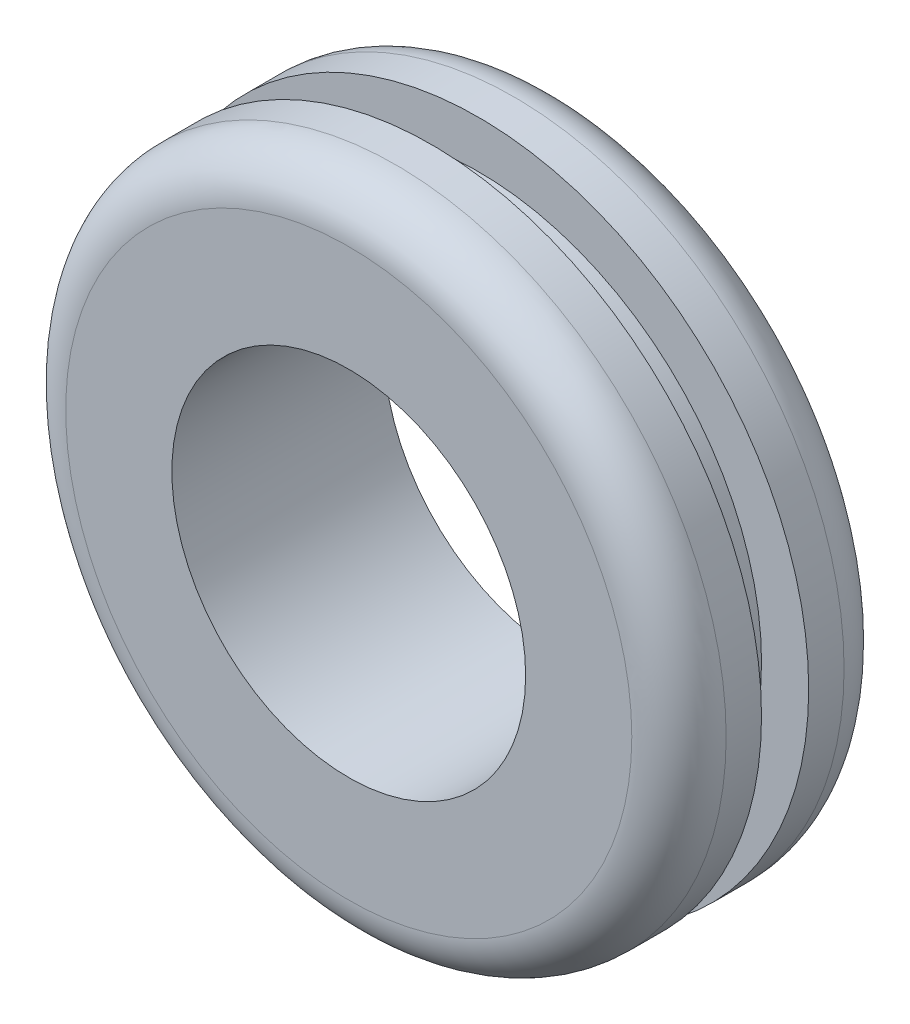
ISO-10303-21;
HEADER;
FILE_DESCRIPTION(('STEP AP214'),'2;1');
FILE_NAME('part.step','',(''),(''),'','','');
FILE_SCHEMA(('AUTOMOTIVE_DESIGN { 1 0 10303 214 1 1 1 1 }'));
ENDSEC;
DATA;
#1=APPLICATION_CONTEXT('core data for automotive mechanical design processes');
#2=APPLICATION_PROTOCOL_DEFINITION('international standard','automotive_design',2000,#1);
#3=PRODUCT_CONTEXT('',#1,'mechanical');
#4=PRODUCT('Part','Part','',(#3));
#5=PRODUCT_RELATED_PRODUCT_CATEGORY('part','',(#4));
#6=PRODUCT_DEFINITION_FORMATION('','',#4);
#7=PRODUCT_DEFINITION_CONTEXT('part definition',#1,'design');
#8=PRODUCT_DEFINITION('design','',#6,#7);
#9=PRODUCT_DEFINITION_SHAPE('','',#8);
#10=(LENGTH_UNIT() NAMED_UNIT(*) SI_UNIT(.MILLI.,.METRE.));
#11=(NAMED_UNIT(*) PLANE_ANGLE_UNIT() SI_UNIT($,.RADIAN.));
#12=(NAMED_UNIT(*) SI_UNIT($,.STERADIAN.) SOLID_ANGLE_UNIT());
#13=UNCERTAINTY_MEASURE_WITH_UNIT(LENGTH_MEASURE(1.E-05),#10,'distance_accuracy_value','');
#14=(GEOMETRIC_REPRESENTATION_CONTEXT(3) GLOBAL_UNCERTAINTY_ASSIGNED_CONTEXT((#13)) GLOBAL_UNIT_ASSIGNED_CONTEXT((#10,
#11,#12)) REPRESENTATION_CONTEXT('',''));
#15=CARTESIAN_POINT('',(0.,0.,0.));
#16=DIRECTION('',(0.,0.,1.));
#17=DIRECTION('',(1.,0.,0.));
#18=AXIS2_PLACEMENT_3D('',#15,#16,#17);
#19=CARTESIAN_POINT('',(0.,0.,4.5));
#20=DIRECTION('',(0.,0.,-1.));
#21=DIRECTION('',(-1.,0.,0.));
#22=AXIS2_PLACEMENT_3D('',#19,#20,#21);
#23=CYLINDRICAL_SURFACE('',#22,14.);
#24=CARTESIAN_POINT('',(0.,0.,2.5));
#25=DIRECTION('',(0.,0.,1.));
#26=DIRECTION('',(1.,0.,0.));
#27=AXIS2_PLACEMENT_3D('',#24,#25,#26);
#28=CIRCLE('',#27,14.);
#29=CARTESIAN_POINT('',(14.,0.,2.5));
#30=VERTEX_POINT('',#29);
#31=EDGE_CURVE('E55',#30,#30,#28,.F.);
#32=ORIENTED_EDGE('',*,*,#31,.T.);
#33=EDGE_LOOP('',(#32));
#34=FACE_BOUND('',#33,.T.);
#35=CARTESIAN_POINT('',(0.,0.,1.));
#36=DIRECTION('',(0.,0.,1.));
#37=DIRECTION('',(1.,0.,0.));
#38=AXIS2_PLACEMENT_3D('',#35,#36,#37);
#39=CIRCLE('',#38,14.);
#40=CARTESIAN_POINT('',(14.,0.,1.));
#41=VERTEX_POINT('',#40);
#42=EDGE_CURVE('E73',#41,#41,#39,.T.);
#43=ORIENTED_EDGE('',*,*,#42,.T.);
#44=EDGE_LOOP('',(#43));
#45=FACE_BOUND('',#44,.T.);
#46=ADVANCED_FACE('F37',(#34,#45),#23,.T.);
#47=CARTESIAN_POINT('',(0.,0.,4.5));
#48=DIRECTION('',(0.,0.,1.));
#49=DIRECTION('',(1.,0.,0.));
#50=AXIS2_PLACEMENT_3D('',#47,#48,#49);
#51=PLANE('',#50);
#52=CARTESIAN_POINT('',(0.,0.,4.5));
#53=DIRECTION('',(0.,0.,1.));
#54=DIRECTION('',(1.,0.,0.));
#55=AXIS2_PLACEMENT_3D('',#52,#53,#54);
#56=CIRCLE('',#55,7.5);
#57=CARTESIAN_POINT('',(7.5,0.,4.5));
#58=VERTEX_POINT('',#57);
#59=EDGE_CURVE('E78',#58,#58,#56,.T.);
#60=ORIENTED_EDGE('',*,*,#59,.F.);
#61=EDGE_LOOP('',(#60));
#62=FACE_BOUND('',#61,.T.);
#63=CARTESIAN_POINT('',(0.,0.,4.5));
#64=DIRECTION('',(0.,0.,1.));
#65=DIRECTION('',(1.,0.,0.));
#66=AXIS2_PLACEMENT_3D('',#63,#64,#65);
#67=CIRCLE('',#66,12.);
#68=CARTESIAN_POINT('',(12.,0.,4.5));
#69=VERTEX_POINT('',#68);
#70=EDGE_CURVE('E10',#69,#69,#67,.T.);
#71=ORIENTED_EDGE('',*,*,#70,.T.);
#72=EDGE_LOOP('',(#71));
#73=FACE_BOUND('',#72,.T.);
#74=ADVANCED_FACE('F95',(#62,#73),#51,.T.);
#75=CARTESIAN_POINT('',(0.,0.,2.5));
#76=DIRECTION('',(0.,0.,1.));
#77=DIRECTION('',(1.,0.,0.));
#78=AXIS2_PLACEMENT_3D('',#75,#76,#77);
#79=TOROIDAL_SURFACE('',#78,12.,2.);
#80=ORIENTED_EDGE('',*,*,#31,.F.);
#81=EDGE_LOOP('',(#80));
#82=FACE_BOUND('',#81,.T.);
#83=ORIENTED_EDGE('',*,*,#70,.F.);
#84=EDGE_LOOP('',(#83));
#85=FACE_BOUND('',#84,.T.);
#86=ADVANCED_FACE('F39',(#82,#85),#79,.T.);
#87=CARTESIAN_POINT('',(0.,14.,1.));
#88=DIRECTION('',(0.,0.,-1.));
#89=DIRECTION('',(-1.,0.,0.));
#90=AXIS2_PLACEMENT_3D('',#87,#88,#89);
#91=PLANE('',#90);
#92=CARTESIAN_POINT('',(0.,0.,0.999999999999999));
#93=DIRECTION('',(0.,0.,1.));
#94=DIRECTION('',(1.,0.,0.));
#95=AXIS2_PLACEMENT_3D('',#92,#93,#94);
#96=CIRCLE('',#95,12.);
#97=CARTESIAN_POINT('',(12.,0.,0.999999999999999));
#98=VERTEX_POINT('',#97);
#99=EDGE_CURVE('E61',#98,#98,#96,.T.);
#100=ORIENTED_EDGE('',*,*,#99,.T.);
#101=EDGE_LOOP('',(#100));
#102=FACE_BOUND('',#101,.T.);
#103=ORIENTED_EDGE('',*,*,#42,.F.);
#104=EDGE_LOOP('',(#103));
#105=FACE_BOUND('',#104,.T.);
#106=ADVANCED_FACE('F102',(#102,#105),#91,.T.);
#107=CARTESIAN_POINT('',(0.,0.,11.5178793470512));
#108=DIRECTION('',(0.,0.,1.));
#109=DIRECTION('',(1.,0.,0.));
#110=AXIS2_PLACEMENT_3D('',#107,#108,#109);
#111=CYLINDRICAL_SURFACE('',#110,12.);
#112=CARTESIAN_POINT('',(0.,0.,-1.));
#113=DIRECTION('',(0.,0.,1.));
#114=DIRECTION('',(1.,0.,0.));
#115=AXIS2_PLACEMENT_3D('',#112,#113,#114);
#116=CIRCLE('',#115,12.);
#117=CARTESIAN_POINT('',(12.,0.,-1.));
#118=VERTEX_POINT('',#117);
#119=EDGE_CURVE('E65',#118,#118,#116,.T.);
#120=ORIENTED_EDGE('',*,*,#119,.T.);
#121=EDGE_LOOP('',(#120));
#122=FACE_BOUND('',#121,.T.);
#123=ORIENTED_EDGE('',*,*,#99,.F.);
#124=EDGE_LOOP('',(#123));
#125=FACE_BOUND('',#124,.T.);
#126=ADVANCED_FACE('F125',(#122,#125),#111,.T.);
#127=CARTESIAN_POINT('',(0.,14.,-1.));
#128=DIRECTION('',(0.,0.,1.));
#129=DIRECTION('',(1.,0.,0.));
#130=AXIS2_PLACEMENT_3D('',#127,#128,#129);
#131=PLANE('',#130);
#132=CARTESIAN_POINT('',(0.,0.,-1.));
#133=DIRECTION('',(0.,0.,1.));
#134=DIRECTION('',(1.,0.,0.));
#135=AXIS2_PLACEMENT_3D('',#132,#133,#134);
#136=CIRCLE('',#135,14.);
#137=CARTESIAN_POINT('',(14.,0.,-1.));
#138=VERTEX_POINT('',#137);
#139=EDGE_CURVE('E69',#138,#138,#136,.T.);
#140=ORIENTED_EDGE('',*,*,#139,.T.);
#141=EDGE_LOOP('',(#140));
#142=FACE_BOUND('',#141,.T.);
#143=ORIENTED_EDGE('',*,*,#119,.F.);
#144=EDGE_LOOP('',(#143));
#145=FACE_BOUND('',#144,.T.);
#146=ADVANCED_FACE('F111',(#142,#145),#131,.T.);
#147=CARTESIAN_POINT('',(0.,0.,-4.5));
#148=DIRECTION('',(0.,0.,1.));
#149=DIRECTION('',(1.,0.,0.));
#150=AXIS2_PLACEMENT_3D('',#147,#148,#149);
#151=PLANE('',#150);
#152=CARTESIAN_POINT('',(0.,0.,-4.5));
#153=DIRECTION('',(0.,0.,1.));
#154=DIRECTION('',(1.,0.,0.));
#155=AXIS2_PLACEMENT_3D('',#152,#153,#154);
#156=CIRCLE('',#155,7.5);
#157=CARTESIAN_POINT('',(7.5,0.,-4.5));
#158=VERTEX_POINT('',#157);
#159=EDGE_CURVE('E77',#158,#158,#156,.T.);
#160=ORIENTED_EDGE('',*,*,#159,.T.);
#161=EDGE_LOOP('',(#160));
#162=FACE_BOUND('',#161,.T.);
#163=CARTESIAN_POINT('',(0.,0.,-4.5));
#164=DIRECTION('',(0.,0.,1.));
#165=DIRECTION('',(1.,0.,0.));
#166=AXIS2_PLACEMENT_3D('',#163,#164,#165);
#167=CIRCLE('',#166,12.);
#168=CARTESIAN_POINT('',(12.,0.,-4.5));
#169=VERTEX_POINT('',#168);
#170=EDGE_CURVE('E45',#169,#169,#167,.F.);
#171=ORIENTED_EDGE('',*,*,#170,.T.);
#172=EDGE_LOOP('',(#171));
#173=FACE_BOUND('',#172,.T.);
#174=ADVANCED_FACE('F86',(#162,#173),#151,.F.);
#175=CARTESIAN_POINT('',(0.,0.,-2.5));
#176=DIRECTION('',(0.,0.,1.));
#177=DIRECTION('',(1.,0.,0.));
#178=AXIS2_PLACEMENT_3D('',#175,#176,#177);
#179=TOROIDAL_SURFACE('',#178,12.,2.);
#180=ORIENTED_EDGE('',*,*,#170,.F.);
#181=EDGE_LOOP('',(#180));
#182=FACE_BOUND('',#181,.T.);
#183=CARTESIAN_POINT('',(0.,0.,-2.5));
#184=DIRECTION('',(0.,0.,1.));
#185=DIRECTION('',(1.,0.,0.));
#186=AXIS2_PLACEMENT_3D('',#183,#184,#185);
#187=CIRCLE('',#186,14.);
#188=CARTESIAN_POINT('',(14.,0.,-2.5));
#189=VERTEX_POINT('',#188);
#190=EDGE_CURVE('E50',#189,#189,#187,.T.);
#191=ORIENTED_EDGE('',*,*,#190,.F.);
#192=EDGE_LOOP('',(#191));
#193=FACE_BOUND('',#192,.T.);
#194=ADVANCED_FACE('F110',(#182,#193),#179,.T.);
#195=ORIENTED_EDGE('',*,*,#190,.T.);
#196=EDGE_LOOP('',(#195));
#197=FACE_BOUND('',#196,.T.);
#198=ORIENTED_EDGE('',*,*,#139,.F.);
#199=EDGE_LOOP('',(#198));
#200=FACE_BOUND('',#199,.T.);
#201=ADVANCED_FACE('F91',(#197,#200),#23,.T.);
#202=CARTESIAN_POINT('',(0.,0.,-4.5));
#203=DIRECTION('',(0.,0.,1.));
#204=DIRECTION('',(1.,0.,0.));
#205=AXIS2_PLACEMENT_3D('',#202,#203,#204);
#206=CYLINDRICAL_SURFACE('',#205,7.5);
#207=ORIENTED_EDGE('',*,*,#159,.F.);
#208=EDGE_LOOP('',(#207));
#209=FACE_BOUND('',#208,.T.);
#210=ORIENTED_EDGE('',*,*,#59,.T.);
#211=EDGE_LOOP('',(#210));
#212=FACE_BOUND('',#211,.T.);
#213=ADVANCED_FACE('F88',(#209,#212),#206,.F.);
#214=CLOSED_SHELL('',(#46,#74,#86,#106,#126,#146,#174,#194,#201,#213));
#215=MANIFOLD_SOLID_BREP('B2',#214);
#216=ADVANCED_BREP_SHAPE_REPRESENTATION('',(#18,#215),#14);
#217=SHAPE_DEFINITION_REPRESENTATION(#9,#216);
ENDSEC;
END-ISO-10303-21;
